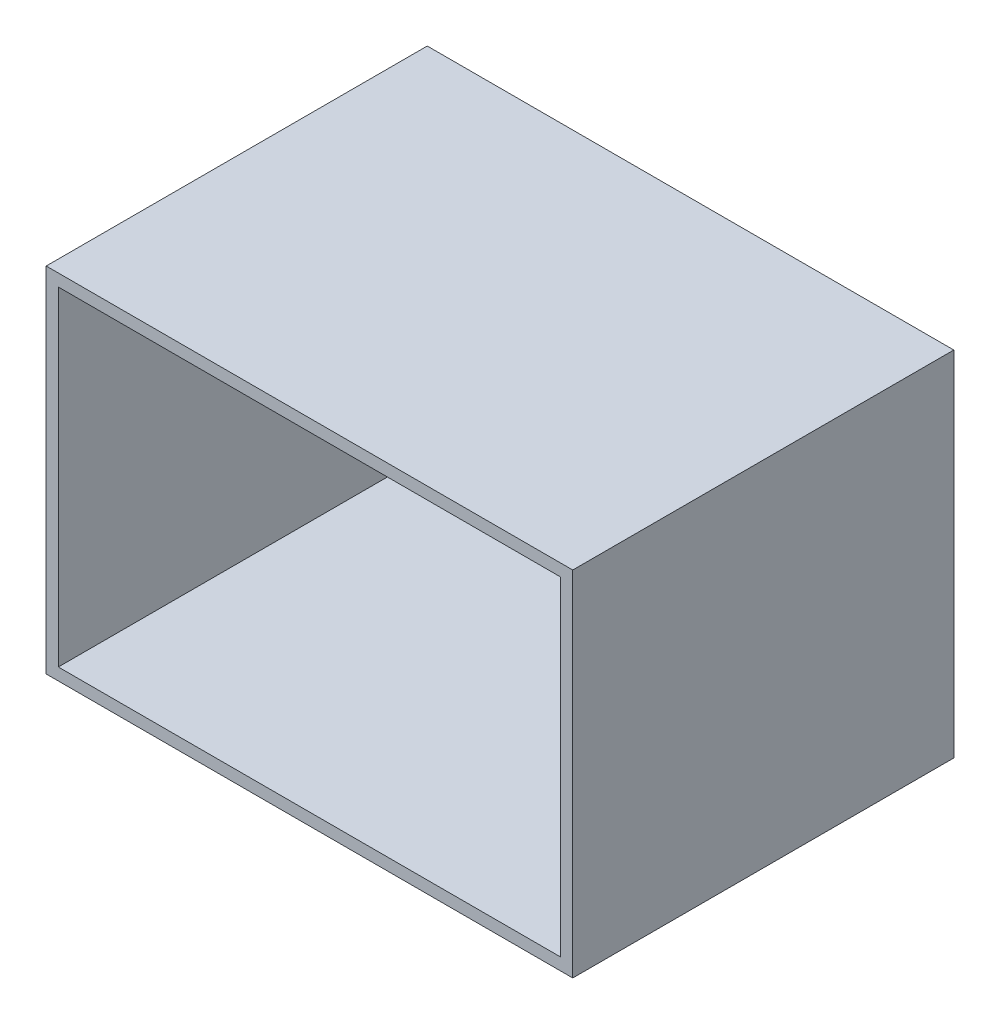
ISO-10303-21;
HEADER;
FILE_DESCRIPTION(('STEP AP214'),'2;1');
FILE_NAME('part.step','',(''),(''),'','','');
FILE_SCHEMA(('AUTOMOTIVE_DESIGN { 1 0 10303 214 1 1 1 1 }'));
ENDSEC;
DATA;
#1=APPLICATION_CONTEXT('core data for automotive mechanical design processes');
#2=APPLICATION_PROTOCOL_DEFINITION('international standard','automotive_design',2000,#1);
#3=PRODUCT_CONTEXT('',#1,'mechanical');
#4=PRODUCT('Part','Part','',(#3));
#5=PRODUCT_RELATED_PRODUCT_CATEGORY('part','',(#4));
#6=PRODUCT_DEFINITION_FORMATION('','',#4);
#7=PRODUCT_DEFINITION_CONTEXT('part definition',#1,'design');
#8=PRODUCT_DEFINITION('design','',#6,#7);
#9=PRODUCT_DEFINITION_SHAPE('','',#8);
#10=(LENGTH_UNIT() NAMED_UNIT(*) SI_UNIT(.MILLI.,.METRE.));
#11=(NAMED_UNIT(*) PLANE_ANGLE_UNIT() SI_UNIT($,.RADIAN.));
#12=(NAMED_UNIT(*) SI_UNIT($,.STERADIAN.) SOLID_ANGLE_UNIT());
#13=UNCERTAINTY_MEASURE_WITH_UNIT(LENGTH_MEASURE(1.E-05),#10,'distance_accuracy_value','');
#14=(GEOMETRIC_REPRESENTATION_CONTEXT(3) GLOBAL_UNCERTAINTY_ASSIGNED_CONTEXT((#13)) GLOBAL_UNIT_ASSIGNED_CONTEXT((#10,
#11,#12)) REPRESENTATION_CONTEXT('',''));
#15=CARTESIAN_POINT('',(0.,0.,0.));
#16=DIRECTION('',(0.,0.,1.));
#17=DIRECTION('',(1.,0.,0.));
#18=AXIS2_PLACEMENT_3D('',#15,#16,#17);
#19=CARTESIAN_POINT('',(0.,0.,55.));
#20=DIRECTION('',(0.,0.,1.));
#21=DIRECTION('',(1.,0.,0.));
#22=AXIS2_PLACEMENT_3D('',#19,#20,#21);
#23=PLANE('',#22);
#24=DIRECTION('',(0.,-1.,0.));
#25=VECTOR('',#24,1.);
#26=CARTESIAN_POINT('',(-35.3565784953624,21.2746478873239,55.));
#27=LINE('',#26,#25);
#28=CARTESIAN_POINT('',(-35.3565784953624,21.2746478873239,55.));
#29=VERTEX_POINT('',#28);
#30=CARTESIAN_POINT('',(-35.3565784953624,-29.7253521126761,55.));
#31=VERTEX_POINT('',#30);
#32=EDGE_CURVE('E134',#29,#31,#27,.T.);
#33=ORIENTED_EDGE('',*,*,#32,.T.);
#34=DIRECTION('',(1.,0.,0.));
#35=VECTOR('',#34,1.);
#36=CARTESIAN_POINT('',(-35.3565784953624,-29.7253521126761,55.));
#37=LINE('',#36,#35);
#38=CARTESIAN_POINT('',(40.6434215046376,-29.7253521126761,55.));
#39=VERTEX_POINT('',#38);
#40=EDGE_CURVE('E137',#31,#39,#37,.T.);
#41=ORIENTED_EDGE('',*,*,#40,.T.);
#42=DIRECTION('',(0.,1.,0.));
#43=VECTOR('',#42,1.);
#44=CARTESIAN_POINT('',(40.6434215046376,21.2746478873239,55.));
#45=LINE('',#44,#43);
#46=CARTESIAN_POINT('',(40.6434215046376,21.2746478873239,55.));
#47=VERTEX_POINT('',#46);
#48=EDGE_CURVE('E140',#39,#47,#45,.T.);
#49=ORIENTED_EDGE('',*,*,#48,.T.);
#50=DIRECTION('',(-1.,0.,0.));
#51=VECTOR('',#50,1.);
#52=CARTESIAN_POINT('',(-35.3565784953624,21.2746478873239,55.));
#53=LINE('',#52,#51);
#54=EDGE_CURVE('E142',#47,#29,#53,.T.);
#55=ORIENTED_EDGE('',*,*,#54,.T.);
#56=EDGE_LOOP('',(#33,#41,#49,#55));
#57=FACE_BOUND('',#56,.T.);
#58=DIRECTION('',(1.,0.,0.));
#59=VECTOR('',#58,1.);
#60=CARTESIAN_POINT('',(-33.6065784953624,-27.9753521126761,55.));
#61=LINE('',#60,#59);
#62=CARTESIAN_POINT('',(-33.6065784953624,-27.9753521126761,55.));
#63=VERTEX_POINT('',#62);
#64=CARTESIAN_POINT('',(38.8934215046376,-27.9753521126761,55.));
#65=VERTEX_POINT('',#64);
#66=EDGE_CURVE('E106',#63,#65,#61,.T.);
#67=ORIENTED_EDGE('',*,*,#66,.F.);
#68=DIRECTION('',(0.,-1.,0.));
#69=VECTOR('',#68,1.);
#70=CARTESIAN_POINT('',(-33.6065784953624,19.5246478873239,55.));
#71=LINE('',#70,#69);
#72=CARTESIAN_POINT('',(-33.6065784953624,19.5246478873239,55.));
#73=VERTEX_POINT('',#72);
#74=EDGE_CURVE('E98',#73,#63,#71,.T.);
#75=ORIENTED_EDGE('',*,*,#74,.F.);
#76=DIRECTION('',(-1.,0.,0.));
#77=VECTOR('',#76,1.);
#78=CARTESIAN_POINT('',(-33.6065784953624,19.5246478873239,55.));
#79=LINE('',#78,#77);
#80=CARTESIAN_POINT('',(38.8934215046376,19.5246478873239,55.));
#81=VERTEX_POINT('',#80);
#82=EDGE_CURVE('E120',#81,#73,#79,.T.);
#83=ORIENTED_EDGE('',*,*,#82,.F.);
#84=DIRECTION('',(0.,1.,0.));
#85=VECTOR('',#84,1.);
#86=CARTESIAN_POINT('',(38.8934215046376,19.5246478873239,55.));
#87=LINE('',#86,#85);
#88=EDGE_CURVE('E118',#65,#81,#87,.T.);
#89=ORIENTED_EDGE('',*,*,#88,.F.);
#90=EDGE_LOOP('',(#67,#75,#83,#89));
#91=FACE_BOUND('',#90,.T.);
#92=ADVANCED_FACE('F33',(#57,#91),#23,.T.);
#93=CARTESIAN_POINT('',(0.,0.,0.));
#94=DIRECTION('',(0.,0.,1.));
#95=DIRECTION('',(1.,0.,0.));
#96=AXIS2_PLACEMENT_3D('',#93,#94,#95);
#97=PLANE('',#96);
#98=DIRECTION('',(0.,-1.,0.));
#99=VECTOR('',#98,1.);
#100=CARTESIAN_POINT('',(-35.3565784953624,21.2746478873239,0.));
#101=LINE('',#100,#99);
#102=CARTESIAN_POINT('',(-35.3565784953624,21.2746478873239,0.));
#103=VERTEX_POINT('',#102);
#104=CARTESIAN_POINT('',(-35.3565784953624,-29.7253521126761,0.));
#105=VERTEX_POINT('',#104);
#106=EDGE_CURVE('E114',#103,#105,#101,.T.);
#107=ORIENTED_EDGE('',*,*,#106,.F.);
#108=DIRECTION('',(-1.,0.,0.));
#109=VECTOR('',#108,1.);
#110=CARTESIAN_POINT('',(-35.3565784953624,21.2746478873239,0.));
#111=LINE('',#110,#109);
#112=CARTESIAN_POINT('',(40.6434215046376,21.2746478873239,0.));
#113=VERTEX_POINT('',#112);
#114=EDGE_CURVE('E138',#113,#103,#111,.T.);
#115=ORIENTED_EDGE('',*,*,#114,.F.);
#116=DIRECTION('',(0.,1.,0.));
#117=VECTOR('',#116,1.);
#118=CARTESIAN_POINT('',(40.6434215046376,21.2746478873239,0.));
#119=LINE('',#118,#117);
#120=CARTESIAN_POINT('',(40.6434215046376,-29.7253521126761,0.));
#121=VERTEX_POINT('',#120);
#122=EDGE_CURVE('E149',#121,#113,#119,.T.);
#123=ORIENTED_EDGE('',*,*,#122,.F.);
#124=DIRECTION('',(1.,0.,0.));
#125=VECTOR('',#124,1.);
#126=CARTESIAN_POINT('',(-35.3565784953624,-29.7253521126761,0.));
#127=LINE('',#126,#125);
#128=EDGE_CURVE('E147',#105,#121,#127,.T.);
#129=ORIENTED_EDGE('',*,*,#128,.F.);
#130=EDGE_LOOP('',(#107,#115,#123,#129));
#131=FACE_BOUND('',#130,.T.);
#132=DIRECTION('',(0.,-1.,0.));
#133=VECTOR('',#132,1.);
#134=CARTESIAN_POINT('',(-33.6065784953624,19.5246478873239,0.));
#135=LINE('',#134,#133);
#136=CARTESIAN_POINT('',(-33.6065784953624,19.5246478873239,0.));
#137=VERTEX_POINT('',#136);
#138=CARTESIAN_POINT('',(-33.6065784953624,-27.9753521126761,0.));
#139=VERTEX_POINT('',#138);
#140=EDGE_CURVE('E56',#137,#139,#135,.T.);
#141=ORIENTED_EDGE('',*,*,#140,.T.);
#142=DIRECTION('',(1.,0.,0.));
#143=VECTOR('',#142,1.);
#144=CARTESIAN_POINT('',(-33.6065784953624,-27.9753521126761,0.));
#145=LINE('',#144,#143);
#146=CARTESIAN_POINT('',(38.8934215046376,-27.9753521126761,0.));
#147=VERTEX_POINT('',#146);
#148=EDGE_CURVE('E113',#139,#147,#145,.T.);
#149=ORIENTED_EDGE('',*,*,#148,.T.);
#150=DIRECTION('',(0.,1.,0.));
#151=VECTOR('',#150,1.);
#152=CARTESIAN_POINT('',(38.8934215046376,19.5246478873239,0.));
#153=LINE('',#152,#151);
#154=CARTESIAN_POINT('',(38.8934215046376,19.5246478873239,0.));
#155=VERTEX_POINT('',#154);
#156=EDGE_CURVE('E126',#147,#155,#153,.T.);
#157=ORIENTED_EDGE('',*,*,#156,.T.);
#158=DIRECTION('',(-1.,0.,0.));
#159=VECTOR('',#158,1.);
#160=CARTESIAN_POINT('',(-33.6065784953624,19.5246478873239,0.));
#161=LINE('',#160,#159);
#162=EDGE_CURVE('E107',#155,#137,#161,.T.);
#163=ORIENTED_EDGE('',*,*,#162,.T.);
#164=EDGE_LOOP('',(#141,#149,#157,#163));
#165=FACE_BOUND('',#164,.T.);
#166=ADVANCED_FACE('F167',(#131,#165),#97,.F.);
#167=CARTESIAN_POINT('',(-35.3565784953624,21.2746478873239,55.));
#168=DIRECTION('',(1.,0.,0.));
#169=DIRECTION('',(0.,1.,0.));
#170=AXIS2_PLACEMENT_3D('',#167,#168,#169);
#171=PLANE('',#170);
#172=ORIENTED_EDGE('',*,*,#106,.T.);
#173=DIRECTION('',(0.,0.,-1.));
#174=VECTOR('',#173,1.);
#175=CARTESIAN_POINT('',(-35.3565784953624,-29.7253521126761,55.));
#176=LINE('',#175,#174);
#177=EDGE_CURVE('E11',#31,#105,#176,.T.);
#178=ORIENTED_EDGE('',*,*,#177,.F.);
#179=ORIENTED_EDGE('',*,*,#32,.F.);
#180=DIRECTION('',(0.,0.,-1.));
#181=VECTOR('',#180,1.);
#182=CARTESIAN_POINT('',(-35.3565784953624,21.2746478873239,55.));
#183=LINE('',#182,#181);
#184=EDGE_CURVE('E144',#29,#103,#183,.T.);
#185=ORIENTED_EDGE('',*,*,#184,.T.);
#186=EDGE_LOOP('',(#172,#178,#179,#185));
#187=FACE_BOUND('',#186,.T.);
#188=ADVANCED_FACE('F35',(#187),#171,.F.);
#189=CARTESIAN_POINT('',(-35.3565784953624,-29.7253521126761,55.));
#190=DIRECTION('',(0.,1.,0.));
#191=DIRECTION('',(0.,0.,1.));
#192=AXIS2_PLACEMENT_3D('',#189,#190,#191);
#193=PLANE('',#192);
#194=ORIENTED_EDGE('',*,*,#128,.T.);
#195=DIRECTION('',(0.,0.,-1.));
#196=VECTOR('',#195,1.);
#197=CARTESIAN_POINT('',(40.6434215046376,-29.7253521126761,55.));
#198=LINE('',#197,#196);
#199=EDGE_CURVE('E41',#39,#121,#198,.T.);
#200=ORIENTED_EDGE('',*,*,#199,.F.);
#201=ORIENTED_EDGE('',*,*,#40,.F.);
#202=ORIENTED_EDGE('',*,*,#177,.T.);
#203=EDGE_LOOP('',(#194,#200,#201,#202));
#204=FACE_BOUND('',#203,.T.);
#205=ADVANCED_FACE('F177',(#204),#193,.F.);
#206=CARTESIAN_POINT('',(40.6434215046376,21.2746478873239,55.));
#207=DIRECTION('',(-1.,0.,0.));
#208=DIRECTION('',(0.,-1.,0.));
#209=AXIS2_PLACEMENT_3D('',#206,#207,#208);
#210=PLANE('',#209);
#211=ORIENTED_EDGE('',*,*,#122,.T.);
#212=DIRECTION('',(0.,0.,-1.));
#213=VECTOR('',#212,1.);
#214=CARTESIAN_POINT('',(40.6434215046376,21.2746478873239,55.));
#215=LINE('',#214,#213);
#216=EDGE_CURVE('E154',#47,#113,#215,.T.);
#217=ORIENTED_EDGE('',*,*,#216,.F.);
#218=ORIENTED_EDGE('',*,*,#48,.F.);
#219=ORIENTED_EDGE('',*,*,#199,.T.);
#220=EDGE_LOOP('',(#211,#217,#218,#219));
#221=FACE_BOUND('',#220,.T.);
#222=ADVANCED_FACE('F161',(#221),#210,.F.);
#223=CARTESIAN_POINT('',(-35.3565784953624,21.2746478873239,55.));
#224=DIRECTION('',(0.,-1.,0.));
#225=DIRECTION('',(0.,0.,-1.));
#226=AXIS2_PLACEMENT_3D('',#223,#224,#225);
#227=PLANE('',#226);
#228=ORIENTED_EDGE('',*,*,#114,.T.);
#229=ORIENTED_EDGE('',*,*,#184,.F.);
#230=ORIENTED_EDGE('',*,*,#54,.F.);
#231=ORIENTED_EDGE('',*,*,#216,.T.);
#232=EDGE_LOOP('',(#228,#229,#230,#231));
#233=FACE_BOUND('',#232,.T.);
#234=ADVANCED_FACE('F171',(#233),#227,.F.);
#235=CARTESIAN_POINT('',(-33.6065784953624,19.5246478873239,55.));
#236=DIRECTION('',(1.,0.,0.));
#237=DIRECTION('',(0.,1.,0.));
#238=AXIS2_PLACEMENT_3D('',#235,#236,#237);
#239=PLANE('',#238);
#240=ORIENTED_EDGE('',*,*,#140,.F.);
#241=DIRECTION('',(0.,0.,-1.));
#242=VECTOR('',#241,1.);
#243=CARTESIAN_POINT('',(-33.6065784953624,19.5246478873239,55.));
#244=LINE('',#243,#242);
#245=EDGE_CURVE('E102',#73,#137,#244,.T.);
#246=ORIENTED_EDGE('',*,*,#245,.F.);
#247=ORIENTED_EDGE('',*,*,#74,.T.);
#248=DIRECTION('',(0.,0.,-1.));
#249=VECTOR('',#248,1.);
#250=CARTESIAN_POINT('',(-33.6065784953624,-27.9753521126761,55.));
#251=LINE('',#250,#249);
#252=EDGE_CURVE('E101',#63,#139,#251,.T.);
#253=ORIENTED_EDGE('',*,*,#252,.T.);
#254=EDGE_LOOP('',(#240,#246,#247,#253));
#255=FACE_BOUND('',#254,.T.);
#256=ADVANCED_FACE('F100',(#255),#239,.T.);
#257=CARTESIAN_POINT('',(-33.6065784953624,-27.9753521126761,55.));
#258=DIRECTION('',(0.,1.,0.));
#259=DIRECTION('',(-1.,0.,0.));
#260=AXIS2_PLACEMENT_3D('',#257,#258,#259);
#261=PLANE('',#260);
#262=ORIENTED_EDGE('',*,*,#148,.F.);
#263=ORIENTED_EDGE('',*,*,#252,.F.);
#264=ORIENTED_EDGE('',*,*,#66,.T.);
#265=DIRECTION('',(0.,0.,-1.));
#266=VECTOR('',#265,1.);
#267=CARTESIAN_POINT('',(38.8934215046376,-27.9753521126761,55.));
#268=LINE('',#267,#266);
#269=EDGE_CURVE('E115',#65,#147,#268,.T.);
#270=ORIENTED_EDGE('',*,*,#269,.T.);
#271=EDGE_LOOP('',(#262,#263,#264,#270));
#272=FACE_BOUND('',#271,.T.);
#273=ADVANCED_FACE('F110',(#272),#261,.T.);
#274=CARTESIAN_POINT('',(38.8934215046376,19.5246478873239,55.));
#275=DIRECTION('',(-1.,0.,0.));
#276=DIRECTION('',(0.,-1.,0.));
#277=AXIS2_PLACEMENT_3D('',#274,#275,#276);
#278=PLANE('',#277);
#279=ORIENTED_EDGE('',*,*,#156,.F.);
#280=ORIENTED_EDGE('',*,*,#269,.F.);
#281=ORIENTED_EDGE('',*,*,#88,.T.);
#282=DIRECTION('',(0.,0.,-1.));
#283=VECTOR('',#282,1.);
#284=CARTESIAN_POINT('',(38.8934215046376,19.5246478873239,55.));
#285=LINE('',#284,#283);
#286=EDGE_CURVE('E48',#81,#155,#285,.T.);
#287=ORIENTED_EDGE('',*,*,#286,.T.);
#288=EDGE_LOOP('',(#279,#280,#281,#287));
#289=FACE_BOUND('',#288,.T.);
#290=ADVANCED_FACE('F200',(#289),#278,.T.);
#291=CARTESIAN_POINT('',(-33.6065784953624,19.5246478873239,55.));
#292=DIRECTION('',(0.,-1.,0.));
#293=DIRECTION('',(0.,0.,-1.));
#294=AXIS2_PLACEMENT_3D('',#291,#292,#293);
#295=PLANE('',#294);
#296=ORIENTED_EDGE('',*,*,#162,.F.);
#297=ORIENTED_EDGE('',*,*,#286,.F.);
#298=ORIENTED_EDGE('',*,*,#82,.T.);
#299=ORIENTED_EDGE('',*,*,#245,.T.);
#300=EDGE_LOOP('',(#296,#297,#298,#299));
#301=FACE_BOUND('',#300,.T.);
#302=ADVANCED_FACE('F204',(#301),#295,.T.);
#303=CLOSED_SHELL('',(#92,#166,#188,#205,#222,#234,#256,#273,#290,#302));
#304=MANIFOLD_SOLID_BREP('B2',#303);
#305=ADVANCED_BREP_SHAPE_REPRESENTATION('',(#18,#304),#14);
#306=SHAPE_DEFINITION_REPRESENTATION(#9,#305);
ENDSEC;
END-ISO-10303-21;
